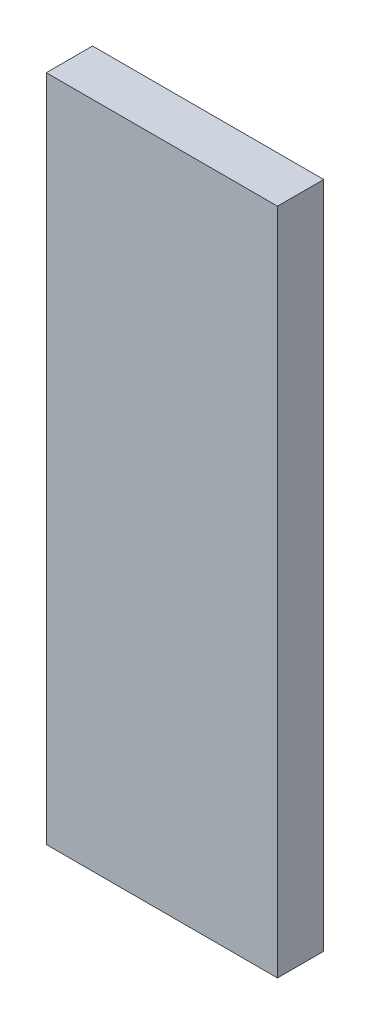
ISO-10303-21;
HEADER;
FILE_DESCRIPTION(('STEP AP214'),'2;1');
FILE_NAME('part.step','',(''),(''),'','','');
FILE_SCHEMA(('AUTOMOTIVE_DESIGN { 1 0 10303 214 1 1 1 1 }'));
ENDSEC;
DATA;
#1=APPLICATION_CONTEXT('core data for automotive mechanical design processes');
#2=APPLICATION_PROTOCOL_DEFINITION('international standard','automotive_design',2000,#1);
#3=PRODUCT_CONTEXT('',#1,'mechanical');
#4=PRODUCT('Part','Part','',(#3));
#5=PRODUCT_RELATED_PRODUCT_CATEGORY('part','',(#4));
#6=PRODUCT_DEFINITION_FORMATION('','',#4);
#7=PRODUCT_DEFINITION_CONTEXT('part definition',#1,'design');
#8=PRODUCT_DEFINITION('design','',#6,#7);
#9=PRODUCT_DEFINITION_SHAPE('','',#8);
#10=(LENGTH_UNIT() NAMED_UNIT(*) SI_UNIT(.MILLI.,.METRE.));
#11=(NAMED_UNIT(*) PLANE_ANGLE_UNIT() SI_UNIT($,.RADIAN.));
#12=(NAMED_UNIT(*) SI_UNIT($,.STERADIAN.) SOLID_ANGLE_UNIT());
#13=UNCERTAINTY_MEASURE_WITH_UNIT(LENGTH_MEASURE(1.E-05),#10,'distance_accuracy_value','');
#14=(GEOMETRIC_REPRESENTATION_CONTEXT(3) GLOBAL_UNCERTAINTY_ASSIGNED_CONTEXT((#13)) GLOBAL_UNIT_ASSIGNED_CONTEXT((#10,
#11,#12)) REPRESENTATION_CONTEXT('',''));
#15=CARTESIAN_POINT('',(0.,0.,0.));
#16=DIRECTION('',(0.,0.,1.));
#17=DIRECTION('',(1.,0.,0.));
#18=AXIS2_PLACEMENT_3D('',#15,#16,#17);
#19=CARTESIAN_POINT('',(0.62500002,1.80691028,0.25000204));
#20=DIRECTION('',(0.,0.,1.));
#21=DIRECTION('',(1.,0.,0.));
#22=AXIS2_PLACEMENT_3D('',#19,#20,#21);
#23=PLANE('',#22);
#24=DIRECTION('',(1.,0.,0.));
#25=VECTOR('',#24,1.);
#26=CARTESIAN_POINT('',(-0.62500002,1.80691028,0.25000204));
#27=LINE('',#26,#25);
#28=CARTESIAN_POINT('',(-0.62500002,1.80691028,0.25000204));
#29=VERTEX_POINT('',#28);
#30=CARTESIAN_POINT('',(0.62500002,1.80691028,0.25000204));
#31=VERTEX_POINT('',#30);
#32=EDGE_CURVE('E27',#29,#31,#27,.T.);
#33=ORIENTED_EDGE('',*,*,#32,.F.);
#34=DIRECTION('',(0.,1.,0.));
#35=VECTOR('',#34,1.);
#36=CARTESIAN_POINT('',(-0.62500002,-1.80690774,0.25000204));
#37=LINE('',#36,#35);
#38=CARTESIAN_POINT('',(-0.62500002,-1.80690774,0.25000204));
#39=VERTEX_POINT('',#38);
#40=EDGE_CURVE('E71',#39,#29,#37,.T.);
#41=ORIENTED_EDGE('',*,*,#40,.F.);
#42=DIRECTION('',(-1.,0.,0.));
#43=VECTOR('',#42,1.);
#44=CARTESIAN_POINT('',(0.62500002,-1.80690774,0.25000204));
#45=LINE('',#44,#43);
#46=CARTESIAN_POINT('',(0.62500002,-1.80690774,0.25000204));
#47=VERTEX_POINT('',#46);
#48=EDGE_CURVE('E74',#47,#39,#45,.T.);
#49=ORIENTED_EDGE('',*,*,#48,.F.);
#50=DIRECTION('',(0.,-1.,0.));
#51=VECTOR('',#50,1.);
#52=CARTESIAN_POINT('',(0.62500002,1.80691028,0.25000204));
#53=LINE('',#52,#51);
#54=EDGE_CURVE('E104',#31,#47,#53,.T.);
#55=ORIENTED_EDGE('',*,*,#54,.F.);
#56=EDGE_LOOP('',(#33,#41,#49,#55));
#57=FACE_BOUND('',#56,.T.);
#58=ADVANCED_FACE('F16',(#57),#23,.T.);
#59=CARTESIAN_POINT('',(0.62500002,1.80691028,0.));
#60=DIRECTION('',(0.,0.,1.));
#61=DIRECTION('',(1.,0.,0.));
#62=AXIS2_PLACEMENT_3D('',#59,#60,#61);
#63=PLANE('',#62);
#64=DIRECTION('',(0.,-1.,0.));
#65=VECTOR('',#64,1.);
#66=CARTESIAN_POINT('',(0.62500002,1.80691028,0.));
#67=LINE('',#66,#65);
#68=CARTESIAN_POINT('',(0.62500002,1.80691028,0.));
#69=VERTEX_POINT('',#68);
#70=CARTESIAN_POINT('',(0.62500002,-1.80690774,0.));
#71=VERTEX_POINT('',#70);
#72=EDGE_CURVE('E91',#69,#71,#67,.T.);
#73=ORIENTED_EDGE('',*,*,#72,.T.);
#74=DIRECTION('',(-1.,0.,0.));
#75=VECTOR('',#74,1.);
#76=CARTESIAN_POINT('',(0.62500002,-1.80690774,0.));
#77=LINE('',#76,#75);
#78=CARTESIAN_POINT('',(-0.62500002,-1.80690774,0.));
#79=VERTEX_POINT('',#78);
#80=EDGE_CURVE('E78',#71,#79,#77,.T.);
#81=ORIENTED_EDGE('',*,*,#80,.T.);
#82=DIRECTION('',(0.,1.,0.));
#83=VECTOR('',#82,1.);
#84=CARTESIAN_POINT('',(-0.62500002,-1.80690774,0.));
#85=LINE('',#84,#83);
#86=CARTESIAN_POINT('',(-0.62500002,1.80691028,0.));
#87=VERTEX_POINT('',#86);
#88=EDGE_CURVE('E63',#79,#87,#85,.T.);
#89=ORIENTED_EDGE('',*,*,#88,.T.);
#90=DIRECTION('',(1.,0.,0.));
#91=VECTOR('',#90,1.);
#92=CARTESIAN_POINT('',(-0.62500002,1.80691028,0.));
#93=LINE('',#92,#91);
#94=EDGE_CURVE('E10',#87,#69,#93,.T.);
#95=ORIENTED_EDGE('',*,*,#94,.T.);
#96=EDGE_LOOP('',(#73,#81,#89,#95));
#97=FACE_BOUND('',#96,.T.);
#98=ADVANCED_FACE('F18',(#97),#63,.F.);
#99=CARTESIAN_POINT('',(-0.62500002,1.80691028,0.));
#100=DIRECTION('',(0.,1.,0.));
#101=DIRECTION('',(1.,0.,0.));
#102=AXIS2_PLACEMENT_3D('',#99,#100,#101);
#103=PLANE('',#102);
#104=DIRECTION('',(0.,0.,1.));
#105=VECTOR('',#104,1.);
#106=CARTESIAN_POINT('',(-0.62500002,1.80691028,0.));
#107=LINE('',#106,#105);
#108=EDGE_CURVE('E77',#87,#29,#107,.T.);
#109=ORIENTED_EDGE('',*,*,#108,.T.);
#110=ORIENTED_EDGE('',*,*,#32,.T.);
#111=DIRECTION('',(0.,0.,1.));
#112=VECTOR('',#111,1.);
#113=CARTESIAN_POINT('',(0.62500002,1.80691028,0.));
#114=LINE('',#113,#112);
#115=EDGE_CURVE('E20',#69,#31,#114,.T.);
#116=ORIENTED_EDGE('',*,*,#115,.F.);
#117=ORIENTED_EDGE('',*,*,#94,.F.);
#118=EDGE_LOOP('',(#109,#110,#116,#117));
#119=FACE_BOUND('',#118,.T.);
#120=ADVANCED_FACE('F113',(#119),#103,.T.);
#121=CARTESIAN_POINT('',(-0.62500002,-1.80690774,0.));
#122=DIRECTION('',(-1.,0.,0.));
#123=DIRECTION('',(0.,0.,1.));
#124=AXIS2_PLACEMENT_3D('',#121,#122,#123);
#125=PLANE('',#124);
#126=DIRECTION('',(0.,0.,1.));
#127=VECTOR('',#126,1.);
#128=CARTESIAN_POINT('',(-0.62500002,-1.80690774,0.));
#129=LINE('',#128,#127);
#130=EDGE_CURVE('E81',#79,#39,#129,.T.);
#131=ORIENTED_EDGE('',*,*,#130,.T.);
#132=ORIENTED_EDGE('',*,*,#40,.T.);
#133=ORIENTED_EDGE('',*,*,#108,.F.);
#134=ORIENTED_EDGE('',*,*,#88,.F.);
#135=EDGE_LOOP('',(#131,#132,#133,#134));
#136=FACE_BOUND('',#135,.T.);
#137=ADVANCED_FACE('F82',(#136),#125,.T.);
#138=CARTESIAN_POINT('',(0.62500002,-1.80690774,0.));
#139=DIRECTION('',(0.,-1.,0.));
#140=DIRECTION('',(0.,0.,-1.));
#141=AXIS2_PLACEMENT_3D('',#138,#139,#140);
#142=PLANE('',#141);
#143=DIRECTION('',(0.,0.,1.));
#144=VECTOR('',#143,1.);
#145=CARTESIAN_POINT('',(0.62500002,-1.80690774,0.));
#146=LINE('',#145,#144);
#147=EDGE_CURVE('E88',#71,#47,#146,.T.);
#148=ORIENTED_EDGE('',*,*,#147,.T.);
#149=ORIENTED_EDGE('',*,*,#48,.T.);
#150=ORIENTED_EDGE('',*,*,#130,.F.);
#151=ORIENTED_EDGE('',*,*,#80,.F.);
#152=EDGE_LOOP('',(#148,#149,#150,#151));
#153=FACE_BOUND('',#152,.T.);
#154=ADVANCED_FACE('F86',(#153),#142,.T.);
#155=CARTESIAN_POINT('',(0.62500002,1.80691028,0.));
#156=DIRECTION('',(1.,0.,0.));
#157=DIRECTION('',(0.,1.,0.));
#158=AXIS2_PLACEMENT_3D('',#155,#156,#157);
#159=PLANE('',#158);
#160=ORIENTED_EDGE('',*,*,#115,.T.);
#161=ORIENTED_EDGE('',*,*,#54,.T.);
#162=ORIENTED_EDGE('',*,*,#147,.F.);
#163=ORIENTED_EDGE('',*,*,#72,.F.);
#164=EDGE_LOOP('',(#160,#161,#162,#163));
#165=FACE_BOUND('',#164,.T.);
#166=ADVANCED_FACE('F117',(#165),#159,.T.);
#167=CLOSED_SHELL('',(#58,#98,#120,#137,#154,#166));
#168=MANIFOLD_SOLID_BREP('B1',#167);
#169=ADVANCED_BREP_SHAPE_REPRESENTATION('',(#18,#168),#14);
#170=SHAPE_DEFINITION_REPRESENTATION(#9,#169);
ENDSEC;
END-ISO-10303-21;
